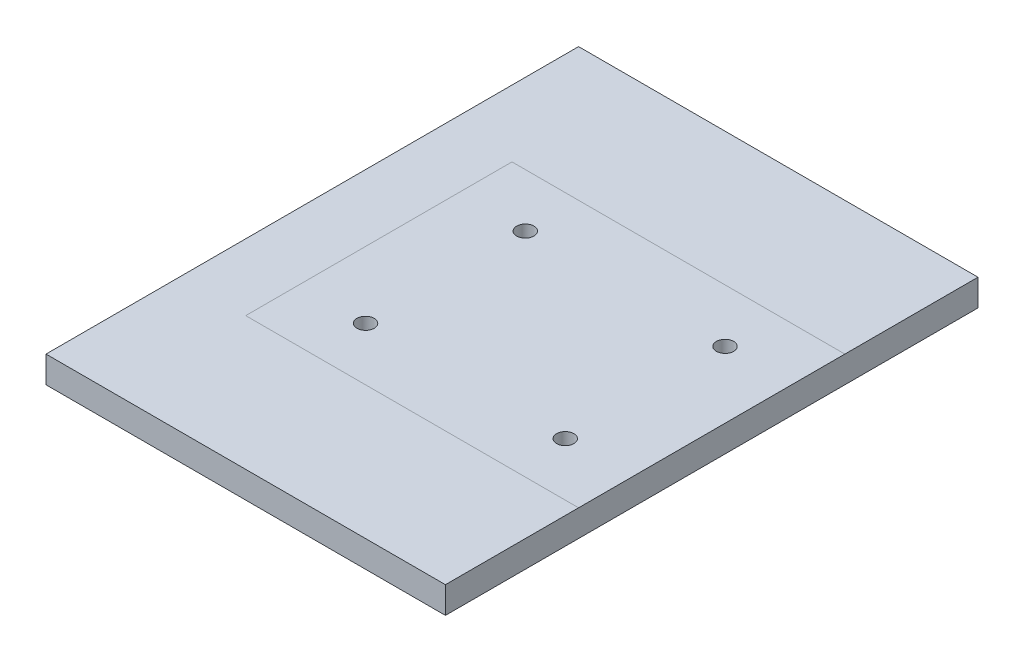
ISO-10303-21;
HEADER;
FILE_DESCRIPTION(('STEP AP214'),'2;1');
FILE_NAME('part.step','',(''),(''),'','','');
FILE_SCHEMA(('AUTOMOTIVE_DESIGN { 1 0 10303 214 1 1 1 1 }'));
ENDSEC;
DATA;
#1=APPLICATION_CONTEXT('core data for automotive mechanical design processes');
#2=APPLICATION_PROTOCOL_DEFINITION('international standard','automotive_design',2000,#1);
#3=PRODUCT_CONTEXT('',#1,'mechanical');
#4=PRODUCT('Part','Part','',(#3));
#5=PRODUCT_RELATED_PRODUCT_CATEGORY('part','',(#4));
#6=PRODUCT_DEFINITION_FORMATION('','',#4);
#7=PRODUCT_DEFINITION_CONTEXT('part definition',#1,'design');
#8=PRODUCT_DEFINITION('design','',#6,#7);
#9=PRODUCT_DEFINITION_SHAPE('','',#8);
#10=(LENGTH_UNIT() NAMED_UNIT(*) SI_UNIT(.MILLI.,.METRE.));
#11=(NAMED_UNIT(*) PLANE_ANGLE_UNIT() SI_UNIT($,.RADIAN.));
#12=(NAMED_UNIT(*) SI_UNIT($,.STERADIAN.) SOLID_ANGLE_UNIT());
#13=UNCERTAINTY_MEASURE_WITH_UNIT(LENGTH_MEASURE(1.E-05),#10,'distance_accuracy_value','');
#14=(GEOMETRIC_REPRESENTATION_CONTEXT(3) GLOBAL_UNCERTAINTY_ASSIGNED_CONTEXT((#13)) GLOBAL_UNIT_ASSIGNED_CONTEXT((#10,
#11,#12)) REPRESENTATION_CONTEXT('',''));
#15=CARTESIAN_POINT('',(0.,0.,0.));
#16=DIRECTION('',(0.,0.,1.));
#17=DIRECTION('',(1.,0.,0.));
#18=AXIS2_PLACEMENT_3D('',#15,#16,#17);
#19=CARTESIAN_POINT('',(-150.,0.,200.));
#20=DIRECTION('',(0.,1.,0.));
#21=DIRECTION('',(0.,0.,1.));
#22=AXIS2_PLACEMENT_3D('',#19,#20,#21);
#23=PLANE('',#22);
#24=DIRECTION('',(0.,0.,-1.));
#25=VECTOR('',#24,1.);
#26=CARTESIAN_POINT('',(-99.9999999999999,0.,200.));
#27=LINE('',#26,#25);
#28=CARTESIAN_POINT('',(-99.9999999999999,0.,100.));
#29=VERTEX_POINT('',#28);
#30=CARTESIAN_POINT('',(-99.9999999999999,0.,-100.));
#31=VERTEX_POINT('',#30);
#32=EDGE_CURVE('E43',#29,#31,#27,.T.);
#33=ORIENTED_EDGE('',*,*,#32,.T.);
#34=DIRECTION('',(1.,0.,0.));
#35=VECTOR('',#34,1.);
#36=CARTESIAN_POINT('',(-150.,0.,-100.));
#37=LINE('',#36,#35);
#38=CARTESIAN_POINT('',(150.,0.,-100.));
#39=VERTEX_POINT('',#38);
#40=EDGE_CURVE('E11',#31,#39,#37,.T.);
#41=ORIENTED_EDGE('',*,*,#40,.T.);
#42=DIRECTION('',(0.,0.,-1.));
#43=VECTOR('',#42,1.);
#44=CARTESIAN_POINT('',(150.,0.,-200.));
#45=LINE('',#44,#43);
#46=CARTESIAN_POINT('',(150.,0.,-200.));
#47=VERTEX_POINT('',#46);
#48=EDGE_CURVE('E102',#39,#47,#45,.T.);
#49=ORIENTED_EDGE('',*,*,#48,.T.);
#50=DIRECTION('',(-1.,0.,0.));
#51=VECTOR('',#50,1.);
#52=CARTESIAN_POINT('',(-150.,0.,-200.));
#53=LINE('',#52,#51);
#54=CARTESIAN_POINT('',(-150.,0.,-200.));
#55=VERTEX_POINT('',#54);
#56=EDGE_CURVE('E105',#47,#55,#53,.T.);
#57=ORIENTED_EDGE('',*,*,#56,.T.);
#58=DIRECTION('',(0.,0.,1.));
#59=VECTOR('',#58,1.);
#60=CARTESIAN_POINT('',(-150.,0.,-200.));
#61=LINE('',#60,#59);
#62=CARTESIAN_POINT('',(-150.,0.,200.));
#63=VERTEX_POINT('',#62);
#64=EDGE_CURVE('E86',#55,#63,#61,.T.);
#65=ORIENTED_EDGE('',*,*,#64,.T.);
#66=DIRECTION('',(1.,0.,0.));
#67=VECTOR('',#66,1.);
#68=CARTESIAN_POINT('',(-150.,0.,200.));
#69=LINE('',#68,#67);
#70=CARTESIAN_POINT('',(150.,0.,200.));
#71=VERTEX_POINT('',#70);
#72=EDGE_CURVE('E97',#63,#71,#69,.T.);
#73=ORIENTED_EDGE('',*,*,#72,.T.);
#74=CARTESIAN_POINT('',(150.,0.,100.));
#75=VERTEX_POINT('',#74);
#76=EDGE_CURVE('E113',#71,#75,#45,.T.);
#77=ORIENTED_EDGE('',*,*,#76,.T.);
#78=DIRECTION('',(-1.,0.,0.));
#79=VECTOR('',#78,1.);
#80=CARTESIAN_POINT('',(-150.,0.,100.));
#81=LINE('',#80,#79);
#82=EDGE_CURVE('E127',#75,#29,#81,.T.);
#83=ORIENTED_EDGE('',*,*,#82,.T.);
#84=EDGE_LOOP('',(#33,#41,#49,#57,#65,#73,#77,#83));
#85=FACE_BOUND('',#84,.T.);
#86=ADVANCED_FACE('F34',(#85),#23,.T.);
#87=CARTESIAN_POINT('',(-150.,-20.,-200.));
#88=DIRECTION('',(-1.,0.,0.));
#89=DIRECTION('',(0.,0.,1.));
#90=AXIS2_PLACEMENT_3D('',#87,#88,#89);
#91=PLANE('',#90);
#92=ORIENTED_EDGE('',*,*,#64,.F.);
#93=DIRECTION('',(0.,1.,0.));
#94=VECTOR('',#93,1.);
#95=CARTESIAN_POINT('',(-150.,-20.,-200.));
#96=LINE('',#95,#94);
#97=CARTESIAN_POINT('',(-150.,-20.,-200.));
#98=VERTEX_POINT('',#97);
#99=EDGE_CURVE('E125',#98,#55,#96,.T.);
#100=ORIENTED_EDGE('',*,*,#99,.F.);
#101=DIRECTION('',(0.,0.,1.));
#102=VECTOR('',#101,1.);
#103=CARTESIAN_POINT('',(-150.,-20.,-200.));
#104=LINE('',#103,#102);
#105=CARTESIAN_POINT('',(-150.,-20.,200.));
#106=VERTEX_POINT('',#105);
#107=EDGE_CURVE('E89',#98,#106,#104,.T.);
#108=ORIENTED_EDGE('',*,*,#107,.T.);
#109=DIRECTION('',(0.,1.,0.));
#110=VECTOR('',#109,1.);
#111=CARTESIAN_POINT('',(-150.,-20.,200.));
#112=LINE('',#111,#110);
#113=EDGE_CURVE('E83',#106,#63,#112,.T.);
#114=ORIENTED_EDGE('',*,*,#113,.T.);
#115=EDGE_LOOP('',(#92,#100,#108,#114));
#116=FACE_BOUND('',#115,.T.);
#117=ADVANCED_FACE('F36',(#116),#91,.T.);
#118=CARTESIAN_POINT('',(-150.,-20.,-200.));
#119=DIRECTION('',(0.,0.,-1.));
#120=DIRECTION('',(-1.,0.,0.));
#121=AXIS2_PLACEMENT_3D('',#118,#119,#120);
#122=PLANE('',#121);
#123=ORIENTED_EDGE('',*,*,#56,.F.);
#124=DIRECTION('',(0.,1.,0.));
#125=VECTOR('',#124,1.);
#126=CARTESIAN_POINT('',(150.,-20.,-200.));
#127=LINE('',#126,#125);
#128=CARTESIAN_POINT('',(150.,-20.,-200.));
#129=VERTEX_POINT('',#128);
#130=EDGE_CURVE('E128',#129,#47,#127,.T.);
#131=ORIENTED_EDGE('',*,*,#130,.F.);
#132=DIRECTION('',(-1.,0.,0.));
#133=VECTOR('',#132,1.);
#134=CARTESIAN_POINT('',(-150.,-20.,-200.));
#135=LINE('',#134,#133);
#136=EDGE_CURVE('E94',#129,#98,#135,.T.);
#137=ORIENTED_EDGE('',*,*,#136,.T.);
#138=ORIENTED_EDGE('',*,*,#99,.T.);
#139=EDGE_LOOP('',(#123,#131,#137,#138));
#140=FACE_BOUND('',#139,.T.);
#141=ADVANCED_FACE('F145',(#140),#122,.T.);
#142=CARTESIAN_POINT('',(150.,-20.,-200.));
#143=DIRECTION('',(1.,0.,0.));
#144=DIRECTION('',(0.,0.,-1.));
#145=AXIS2_PLACEMENT_3D('',#142,#143,#144);
#146=PLANE('',#145);
#147=ORIENTED_EDGE('',*,*,#76,.F.);
#148=DIRECTION('',(0.,1.,0.));
#149=VECTOR('',#148,1.);
#150=CARTESIAN_POINT('',(150.,-20.,200.));
#151=LINE('',#150,#149);
#152=CARTESIAN_POINT('',(150.,-20.,200.));
#153=VERTEX_POINT('',#152);
#154=EDGE_CURVE('E93',#153,#71,#151,.T.);
#155=ORIENTED_EDGE('',*,*,#154,.F.);
#156=DIRECTION('',(0.,0.,-1.));
#157=VECTOR('',#156,1.);
#158=CARTESIAN_POINT('',(150.,-20.,-200.));
#159=LINE('',#158,#157);
#160=EDGE_CURVE('E120',#153,#129,#159,.T.);
#161=ORIENTED_EDGE('',*,*,#160,.T.);
#162=ORIENTED_EDGE('',*,*,#130,.T.);
#163=ORIENTED_EDGE('',*,*,#48,.F.);
#164=EDGE_CURVE('E115',#75,#39,#45,.T.);
#165=ORIENTED_EDGE('',*,*,#164,.F.);
#166=EDGE_LOOP('',(#147,#155,#161,#162,#163,#165));
#167=FACE_BOUND('',#166,.T.);
#168=ADVANCED_FACE('F141',(#167),#146,.T.);
#169=CARTESIAN_POINT('',(-150.,-20.,200.));
#170=DIRECTION('',(0.,0.,1.));
#171=DIRECTION('',(1.,0.,0.));
#172=AXIS2_PLACEMENT_3D('',#169,#170,#171);
#173=PLANE('',#172);
#174=ORIENTED_EDGE('',*,*,#72,.F.);
#175=ORIENTED_EDGE('',*,*,#113,.F.);
#176=DIRECTION('',(1.,0.,0.));
#177=VECTOR('',#176,1.);
#178=CARTESIAN_POINT('',(-150.,-20.,200.));
#179=LINE('',#178,#177);
#180=EDGE_CURVE('E118',#106,#153,#179,.T.);
#181=ORIENTED_EDGE('',*,*,#180,.T.);
#182=ORIENTED_EDGE('',*,*,#154,.T.);
#183=EDGE_LOOP('',(#174,#175,#181,#182));
#184=FACE_BOUND('',#183,.T.);
#185=ADVANCED_FACE('F98',(#184),#173,.T.);
#186=CARTESIAN_POINT('',(-150.,-20.,200.));
#187=DIRECTION('',(0.,1.,0.));
#188=DIRECTION('',(0.,0.,1.));
#189=AXIS2_PLACEMENT_3D('',#186,#187,#188);
#190=PLANE('',#189);
#191=CARTESIAN_POINT('',(100.,-20.,60.));
#192=DIRECTION('',(0.,1.,0.));
#193=DIRECTION('',(0.,0.,1.));
#194=AXIS2_PLACEMENT_3D('',#191,#192,#193);
#195=CIRCLE('',#194,6.5);
#196=CARTESIAN_POINT('',(100.,-20.,66.5));
#197=VERTEX_POINT('',#196);
#198=EDGE_CURVE('E183',#197,#197,#195,.T.);
#199=ORIENTED_EDGE('',*,*,#198,.T.);
#200=EDGE_LOOP('',(#199));
#201=FACE_BOUND('',#200,.T.);
#202=CARTESIAN_POINT('',(-50.,-20.,60.));
#203=DIRECTION('',(0.,1.,0.));
#204=DIRECTION('',(0.,0.,1.));
#205=AXIS2_PLACEMENT_3D('',#202,#203,#204);
#206=CIRCLE('',#205,6.5);
#207=CARTESIAN_POINT('',(-50.,-20.,66.5));
#208=VERTEX_POINT('',#207);
#209=EDGE_CURVE('E193',#208,#208,#206,.T.);
#210=ORIENTED_EDGE('',*,*,#209,.T.);
#211=EDGE_LOOP('',(#210));
#212=FACE_BOUND('',#211,.T.);
#213=CARTESIAN_POINT('',(-50.,-20.,-60.));
#214=DIRECTION('',(0.,1.,0.));
#215=DIRECTION('',(0.,0.,1.));
#216=AXIS2_PLACEMENT_3D('',#213,#214,#215);
#217=CIRCLE('',#216,6.5);
#218=CARTESIAN_POINT('',(-50.,-20.,-53.5));
#219=VERTEX_POINT('',#218);
#220=EDGE_CURVE('E199',#219,#219,#217,.T.);
#221=ORIENTED_EDGE('',*,*,#220,.T.);
#222=EDGE_LOOP('',(#221));
#223=FACE_BOUND('',#222,.T.);
#224=CARTESIAN_POINT('',(100.,-20.,-60.));
#225=DIRECTION('',(0.,1.,0.));
#226=DIRECTION('',(0.,0.,1.));
#227=AXIS2_PLACEMENT_3D('',#224,#225,#226);
#228=CIRCLE('',#227,6.5);
#229=CARTESIAN_POINT('',(100.,-20.,-53.5));
#230=VERTEX_POINT('',#229);
#231=EDGE_CURVE('E106',#230,#230,#228,.T.);
#232=ORIENTED_EDGE('',*,*,#231,.T.);
#233=EDGE_LOOP('',(#232));
#234=FACE_BOUND('',#233,.T.);
#235=ORIENTED_EDGE('',*,*,#107,.F.);
#236=ORIENTED_EDGE('',*,*,#136,.F.);
#237=ORIENTED_EDGE('',*,*,#160,.F.);
#238=ORIENTED_EDGE('',*,*,#180,.F.);
#239=EDGE_LOOP('',(#235,#236,#237,#238));
#240=FACE_BOUND('',#239,.T.);
#241=ADVANCED_FACE('F147',(#201,#212,#223,#234,#240),#190,.F.);
#242=ORIENTED_EDGE('',*,*,#40,.F.);
#243=ORIENTED_EDGE('',*,*,#32,.F.);
#244=ORIENTED_EDGE('',*,*,#82,.F.);
#245=ORIENTED_EDGE('',*,*,#164,.T.);
#246=EDGE_LOOP('',(#242,#243,#244,#245));
#247=FACE_BOUND('',#246,.T.);
#248=CARTESIAN_POINT('',(100.,0.,60.));
#249=DIRECTION('',(0.,1.,0.));
#250=DIRECTION('',(0.,0.,1.));
#251=AXIS2_PLACEMENT_3D('',#248,#249,#250);
#252=CIRCLE('',#251,6.5);
#253=CARTESIAN_POINT('',(100.,0.,66.5));
#254=VERTEX_POINT('',#253);
#255=EDGE_CURVE('E186',#254,#254,#252,.T.);
#256=ORIENTED_EDGE('',*,*,#255,.F.);
#257=EDGE_LOOP('',(#256));
#258=FACE_BOUND('',#257,.T.);
#259=CARTESIAN_POINT('',(-50.,0.,60.));
#260=DIRECTION('',(0.,1.,0.));
#261=DIRECTION('',(0.,0.,1.));
#262=AXIS2_PLACEMENT_3D('',#259,#260,#261);
#263=CIRCLE('',#262,6.5);
#264=CARTESIAN_POINT('',(-50.,0.,66.5));
#265=VERTEX_POINT('',#264);
#266=EDGE_CURVE('E188',#265,#265,#263,.T.);
#267=ORIENTED_EDGE('',*,*,#266,.F.);
#268=EDGE_LOOP('',(#267));
#269=FACE_BOUND('',#268,.T.);
#270=CARTESIAN_POINT('',(-50.,0.,-60.));
#271=DIRECTION('',(0.,1.,0.));
#272=DIRECTION('',(0.,0.,1.));
#273=AXIS2_PLACEMENT_3D('',#270,#271,#272);
#274=CIRCLE('',#273,6.5);
#275=CARTESIAN_POINT('',(-50.,0.,-53.5));
#276=VERTEX_POINT('',#275);
#277=EDGE_CURVE('E196',#276,#276,#274,.T.);
#278=ORIENTED_EDGE('',*,*,#277,.F.);
#279=EDGE_LOOP('',(#278));
#280=FACE_BOUND('',#279,.T.);
#281=CARTESIAN_POINT('',(100.,0.,-60.));
#282=DIRECTION('',(0.,1.,0.));
#283=DIRECTION('',(0.,0.,1.));
#284=AXIS2_PLACEMENT_3D('',#281,#282,#283);
#285=CIRCLE('',#284,6.5);
#286=CARTESIAN_POINT('',(100.,0.,-53.5));
#287=VERTEX_POINT('',#286);
#288=EDGE_CURVE('E109',#287,#287,#285,.T.);
#289=ORIENTED_EDGE('',*,*,#288,.F.);
#290=EDGE_LOOP('',(#289));
#291=FACE_BOUND('',#290,.T.);
#292=ADVANCED_FACE('F138',(#247,#258,#269,#280,#291),#23,.T.);
#293=CARTESIAN_POINT('',(100.,-20.,-60.));
#294=DIRECTION('',(0.,1.,0.));
#295=DIRECTION('',(0.,0.,1.));
#296=AXIS2_PLACEMENT_3D('',#293,#294,#295);
#297=CYLINDRICAL_SURFACE('',#296,6.5);
#298=ORIENTED_EDGE('',*,*,#231,.F.);
#299=EDGE_LOOP('',(#298));
#300=FACE_BOUND('',#299,.T.);
#301=ORIENTED_EDGE('',*,*,#288,.T.);
#302=EDGE_LOOP('',(#301));
#303=FACE_BOUND('',#302,.T.);
#304=ADVANCED_FACE('F155',(#300,#303),#297,.F.);
#305=CARTESIAN_POINT('',(-50.,-20.,-60.));
#306=DIRECTION('',(0.,1.,0.));
#307=DIRECTION('',(0.,0.,1.));
#308=AXIS2_PLACEMENT_3D('',#305,#306,#307);
#309=CYLINDRICAL_SURFACE('',#308,6.5);
#310=ORIENTED_EDGE('',*,*,#220,.F.);
#311=EDGE_LOOP('',(#310));
#312=FACE_BOUND('',#311,.T.);
#313=ORIENTED_EDGE('',*,*,#277,.T.);
#314=EDGE_LOOP('',(#313));
#315=FACE_BOUND('',#314,.T.);
#316=ADVANCED_FACE('F167',(#312,#315),#309,.F.);
#317=CARTESIAN_POINT('',(-50.,-20.,60.));
#318=DIRECTION('',(0.,1.,0.));
#319=DIRECTION('',(0.,0.,1.));
#320=AXIS2_PLACEMENT_3D('',#317,#318,#319);
#321=CYLINDRICAL_SURFACE('',#320,6.5);
#322=ORIENTED_EDGE('',*,*,#209,.F.);
#323=EDGE_LOOP('',(#322));
#324=FACE_BOUND('',#323,.T.);
#325=ORIENTED_EDGE('',*,*,#266,.T.);
#326=EDGE_LOOP('',(#325));
#327=FACE_BOUND('',#326,.T.);
#328=ADVANCED_FACE('F171',(#324,#327),#321,.F.);
#329=CARTESIAN_POINT('',(100.,-20.,60.));
#330=DIRECTION('',(0.,1.,0.));
#331=DIRECTION('',(0.,0.,1.));
#332=AXIS2_PLACEMENT_3D('',#329,#330,#331);
#333=CYLINDRICAL_SURFACE('',#332,6.5);
#334=ORIENTED_EDGE('',*,*,#198,.F.);
#335=EDGE_LOOP('',(#334));
#336=FACE_BOUND('',#335,.T.);
#337=ORIENTED_EDGE('',*,*,#255,.T.);
#338=EDGE_LOOP('',(#337));
#339=FACE_BOUND('',#338,.T.);
#340=ADVANCED_FACE('F175',(#336,#339),#333,.F.);
#341=CLOSED_SHELL('',(#86,#117,#141,#168,#185,#241,#292,#304,#316,#328,#340));
#342=MANIFOLD_SOLID_BREP('B2',#341);
#343=ADVANCED_BREP_SHAPE_REPRESENTATION('',(#18,#342),#14);
#344=SHAPE_DEFINITION_REPRESENTATION(#9,#343);
ENDSEC;
END-ISO-10303-21;
